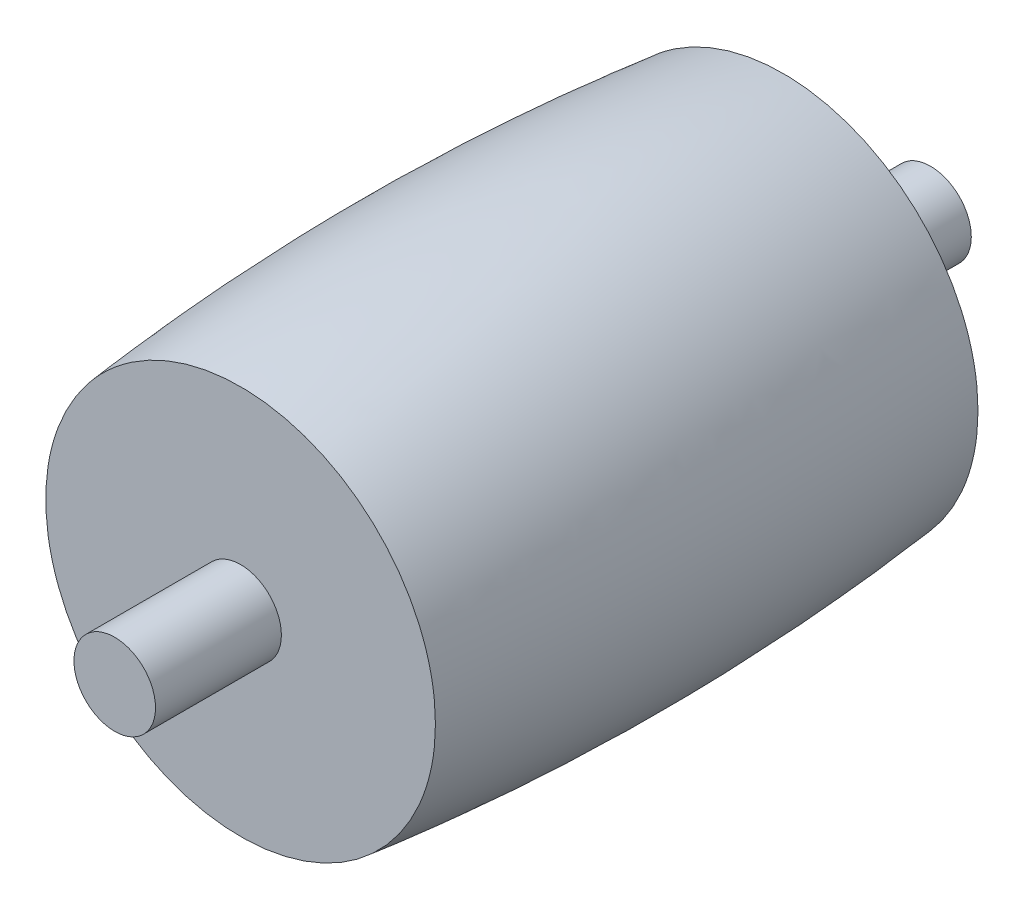
ISO-10303-21;
HEADER;
FILE_DESCRIPTION(('STEP AP214'),'2;1');
FILE_NAME('part.step','',(''),(''),'','','');
FILE_SCHEMA(('AUTOMOTIVE_DESIGN { 1 0 10303 214 1 1 1 1 }'));
ENDSEC;
DATA;
#1=APPLICATION_CONTEXT('core data for automotive mechanical design processes');
#2=APPLICATION_PROTOCOL_DEFINITION('international standard','automotive_design',2000,#1);
#3=PRODUCT_CONTEXT('',#1,'mechanical');
#4=PRODUCT('Part','Part','',(#3));
#5=PRODUCT_RELATED_PRODUCT_CATEGORY('part','',(#4));
#6=PRODUCT_DEFINITION_FORMATION('','',#4);
#7=PRODUCT_DEFINITION_CONTEXT('part definition',#1,'design');
#8=PRODUCT_DEFINITION('design','',#6,#7);
#9=PRODUCT_DEFINITION_SHAPE('','',#8);
#10=(LENGTH_UNIT() NAMED_UNIT(*) SI_UNIT(.MILLI.,.METRE.));
#11=(NAMED_UNIT(*) PLANE_ANGLE_UNIT() SI_UNIT($,.RADIAN.));
#12=(NAMED_UNIT(*) SI_UNIT($,.STERADIAN.) SOLID_ANGLE_UNIT());
#13=UNCERTAINTY_MEASURE_WITH_UNIT(LENGTH_MEASURE(1.E-05),#10,'distance_accuracy_value','');
#14=(GEOMETRIC_REPRESENTATION_CONTEXT(3) GLOBAL_UNCERTAINTY_ASSIGNED_CONTEXT((#13)) GLOBAL_UNIT_ASSIGNED_CONTEXT((#10,
#11,#12)) REPRESENTATION_CONTEXT('',''));
#15=CARTESIAN_POINT('',(0.,0.,0.));
#16=DIRECTION('',(0.,0.,1.));
#17=DIRECTION('',(1.,0.,0.));
#18=AXIS2_PLACEMENT_3D('',#15,#16,#17);
#19=CARTESIAN_POINT('',(0.,0.,20.));
#20=DIRECTION('',(0.,0.,-1.));
#21=DIRECTION('',(-1.,0.,0.));
#22=AXIS2_PLACEMENT_3D('',#19,#20,#21);
#23=CYLINDRICAL_SURFACE('',#22,1.);
#24=CARTESIAN_POINT('',(0.,0.,3.61277325484366));
#25=DIRECTION('',(0.,0.,-1.));
#26=DIRECTION('',(-1.,0.,0.));
#27=AXIS2_PLACEMENT_3D('',#24,#25,#26);
#28=CIRCLE('',#27,1.);
#29=CARTESIAN_POINT('',(1.,0.,3.61277325484366));
#30=VERTEX_POINT('',#29);
#31=EDGE_CURVE('E11',#30,#30,#28,.T.);
#32=ORIENTED_EDGE('',*,*,#31,.T.);
#33=EDGE_LOOP('',(#32));
#34=FACE_BOUND('',#33,.T.);
#35=CARTESIAN_POINT('',(0.,0.,0.));
#36=DIRECTION('',(0.,0.,1.));
#37=DIRECTION('',(1.,0.,0.));
#38=AXIS2_PLACEMENT_3D('',#35,#36,#37);
#39=CIRCLE('',#38,1.);
#40=CARTESIAN_POINT('',(1.,0.,0.));
#41=VERTEX_POINT('',#40);
#42=EDGE_CURVE('E90',#41,#41,#39,.T.);
#43=ORIENTED_EDGE('',*,*,#42,.T.);
#44=EDGE_LOOP('',(#43));
#45=FACE_BOUND('',#44,.T.);
#46=ADVANCED_FACE('F41',(#34,#45),#23,.T.);
#47=CARTESIAN_POINT('',(0.,0.,0.));
#48=DIRECTION('',(0.,0.,1.));
#49=DIRECTION('',(1.,0.,0.));
#50=AXIS2_PLACEMENT_3D('',#47,#48,#49);
#51=PLANE('',#50);
#52=ORIENTED_EDGE('',*,*,#42,.F.);
#53=EDGE_LOOP('',(#52));
#54=FACE_BOUND('',#53,.T.);
#55=ADVANCED_FACE('F115',(#54),#51,.F.);
#56=CARTESIAN_POINT('',(0.,0.,3.61277325484366));
#57=DIRECTION('',(0.,0.,-1.));
#58=DIRECTION('',(-1.,0.,0.));
#59=AXIS2_PLACEMENT_3D('',#56,#57,#58);
#60=PLANE('',#59);
#61=ORIENTED_EDGE('',*,*,#31,.F.);
#62=EDGE_LOOP('',(#61));
#63=FACE_BOUND('',#62,.T.);
#64=CARTESIAN_POINT('',(0.,0.,3.61277325484366));
#65=DIRECTION('',(0.,0.,1.));
#66=DIRECTION('',(1.,0.,0.));
#67=AXIS2_PLACEMENT_3D('',#64,#65,#66);
#68=CIRCLE('',#67,4.77690427962961);
#69=CARTESIAN_POINT('',(4.77690427962961,0.,3.61277325484366));
#70=VERTEX_POINT('',#69);
#71=EDGE_CURVE('E81',#70,#70,#68,.T.);
#72=ORIENTED_EDGE('',*,*,#71,.F.);
#73=EDGE_LOOP('',(#72));
#74=FACE_BOUND('',#73,.T.);
#75=ADVANCED_FACE('F120',(#63,#74),#60,.T.);
#76=CARTESIAN_POINT('',(4.77690427962961,0.,16.9143399158512));
#77=CARTESIAN_POINT('',(4.77690427962961,9.55380855925922,16.9143399158512));
#78=CARTESIAN_POINT('',(-4.77690427962961,9.55380855925922,16.9143399158512));
#79=CARTESIAN_POINT('',(-4.77690427962961,0.,16.9143399158512));
#80=CARTESIAN_POINT('',(-4.77690427962961,-9.55380855925922,16.9143399158512));
#81=CARTESIAN_POINT('',(4.77690427962961,-9.55380855925922,16.9143399158512));
#82=CARTESIAN_POINT('',(4.77690427962961,0.,16.9143399158512));
#83=CARTESIAN_POINT('',(5.50586744156076,0.,10.2619782069855));
#84=CARTESIAN_POINT('',(5.50586744156076,11.0117348831215,10.2619782069855));
#85=CARTESIAN_POINT('',(-5.50586744156076,11.0117348831215,10.2619782069855));
#86=CARTESIAN_POINT('',(-5.50586744156076,0.,10.2619782069855));
#87=CARTESIAN_POINT('',(-5.50586744156076,-11.0117348831215,10.2619782069855));
#88=CARTESIAN_POINT('',(5.50586744156076,-11.0117348831215,10.2619782069855));
#89=CARTESIAN_POINT('',(5.50586744156076,0.,10.2619782069855));
#90=CARTESIAN_POINT('',(4.77690427962961,0.,3.61277325484366));
#91=CARTESIAN_POINT('',(4.77690427962961,9.55380855925922,3.61277325484366));
#92=CARTESIAN_POINT('',(-4.77690427962961,9.55380855925922,3.61277325484366));
#93=CARTESIAN_POINT('',(-4.77690427962961,0.,3.61277325484366));
#94=CARTESIAN_POINT('',(-4.77690427962961,-9.55380855925922,3.61277325484366));
#95=CARTESIAN_POINT('',(4.77690427962961,-9.55380855925922,3.61277325484366));
#96=CARTESIAN_POINT('',(4.77690427962961,0.,3.61277325484366));
#97=(BOUNDED_SURFACE() B_SPLINE_SURFACE(2,3,((#76,#77,#78,#79,#80,#81,#82),(#83,#84,#85,#86,#87,
#88,#89),(#90,#91,#92,#93,#94,#95,#96)),.UNSPECIFIED.,.F.,.T.,
.F.) B_SPLINE_SURFACE_WITH_KNOTS((3,3),(4,3,4),(0.,1.),(0.,0.5,1.),
.UNSPECIFIED.) GEOMETRIC_REPRESENTATION_ITEM() RATIONAL_B_SPLINE_SURFACE(((1.,0.333333333333333,
0.333333333333333,1.,0.333333333333333,0.333333333333333,1.),(1.,0.333333333333333,
0.333333333333333,1.,0.333333333333333,0.333333333333333,1.),(1.,0.333333333333333,
0.333333333333333,1.,0.333333333333333,0.333333333333333,1.))) REPRESENTATION_ITEM('') SURFACE());
#98=CARTESIAN_POINT('',(4.77690427962961,0.,16.9143399158512));
#99=CARTESIAN_POINT('',(5.50586744156076,0.,10.2619782069855));
#100=CARTESIAN_POINT('',(4.77690427962961,0.,3.61277325484366));
#101=B_SPLINE_CURVE_WITH_KNOTS('',2,(#98,#99,#100),.UNSPECIFIED.,.F.,.F.,(3,3),(0.,1.),.UNSPECIFIED.);
#102=CARTESIAN_POINT('',(4.77690427962961,0.,16.9143399158512));
#103=VERTEX_POINT('',#102);
#104=EDGE_CURVE('E74',#103,#70,#101,.T.);
#105=CARTESIAN_POINT('',(0.,0.,16.9143399158512));
#106=DIRECTION('',(0.,0.,1.));
#107=DIRECTION('',(1.,0.,0.));
#108=AXIS2_PLACEMENT_3D('',#105,#106,#107);
#109=CIRCLE('',#108,4.77690427962961);
#110=EDGE_CURVE('E71',#103,#103,#109,.T.);
#111=ORIENTED_EDGE('',*,*,#104,.F.);
#112=ORIENTED_EDGE('',*,*,#110,.F.);
#113=ORIENTED_EDGE('',*,*,#104,.T.);
#114=ORIENTED_EDGE('',*,*,#71,.T.);
#115=EDGE_LOOP('',(#111,#112,#113,#114));
#116=FACE_BOUND('',#115,.T.);
#117=ADVANCED_FACE('F111',(#116),#97,.T.);
#118=CARTESIAN_POINT('',(0.,0.,16.9143399158512));
#119=DIRECTION('',(0.,0.,1.));
#120=DIRECTION('',(1.,0.,0.));
#121=AXIS2_PLACEMENT_3D('',#118,#119,#120);
#122=PLANE('',#121);
#123=CARTESIAN_POINT('',(0.,0.,16.9143399158512));
#124=DIRECTION('',(0.,0.,1.));
#125=DIRECTION('',(1.,0.,0.));
#126=AXIS2_PLACEMENT_3D('',#123,#124,#125);
#127=CIRCLE('',#126,1.);
#128=CARTESIAN_POINT('',(1.,0.,16.9143399158512));
#129=VERTEX_POINT('',#128);
#130=EDGE_CURVE('E50',#129,#129,#127,.T.);
#131=ORIENTED_EDGE('',*,*,#130,.F.);
#132=EDGE_LOOP('',(#131));
#133=FACE_BOUND('',#132,.T.);
#134=ORIENTED_EDGE('',*,*,#110,.T.);
#135=EDGE_LOOP('',(#134));
#136=FACE_BOUND('',#135,.T.);
#137=ADVANCED_FACE('F69',(#133,#136),#122,.T.);
#138=CARTESIAN_POINT('',(0.,0.,20.));
#139=DIRECTION('',(0.,0.,1.));
#140=DIRECTION('',(1.,0.,0.));
#141=AXIS2_PLACEMENT_3D('',#138,#139,#140);
#142=PLANE('',#141);
#143=CARTESIAN_POINT('',(0.,0.,20.));
#144=DIRECTION('',(0.,0.,1.));
#145=DIRECTION('',(1.,0.,0.));
#146=AXIS2_PLACEMENT_3D('',#143,#144,#145);
#147=CIRCLE('',#146,1.);
#148=CARTESIAN_POINT('',(1.,0.,20.));
#149=VERTEX_POINT('',#148);
#150=EDGE_CURVE('E93',#149,#149,#147,.T.);
#151=ORIENTED_EDGE('',*,*,#150,.T.);
#152=EDGE_LOOP('',(#151));
#153=FACE_BOUND('',#152,.T.);
#154=ADVANCED_FACE('F103',(#153),#142,.T.);
#155=ORIENTED_EDGE('',*,*,#130,.T.);
#156=EDGE_LOOP('',(#155));
#157=FACE_BOUND('',#156,.T.);
#158=ORIENTED_EDGE('',*,*,#150,.F.);
#159=EDGE_LOOP('',(#158));
#160=FACE_BOUND('',#159,.T.);
#161=ADVANCED_FACE('F43',(#157,#160),#23,.T.);
#162=CLOSED_SHELL('',(#46,#55,#75,#117,#137,#154,#161));
#163=MANIFOLD_SOLID_BREP('B2',#162);
#164=ADVANCED_BREP_SHAPE_REPRESENTATION('',(#18,#163),#14);
#165=SHAPE_DEFINITION_REPRESENTATION(#9,#164);
ENDSEC;
END-ISO-10303-21;
